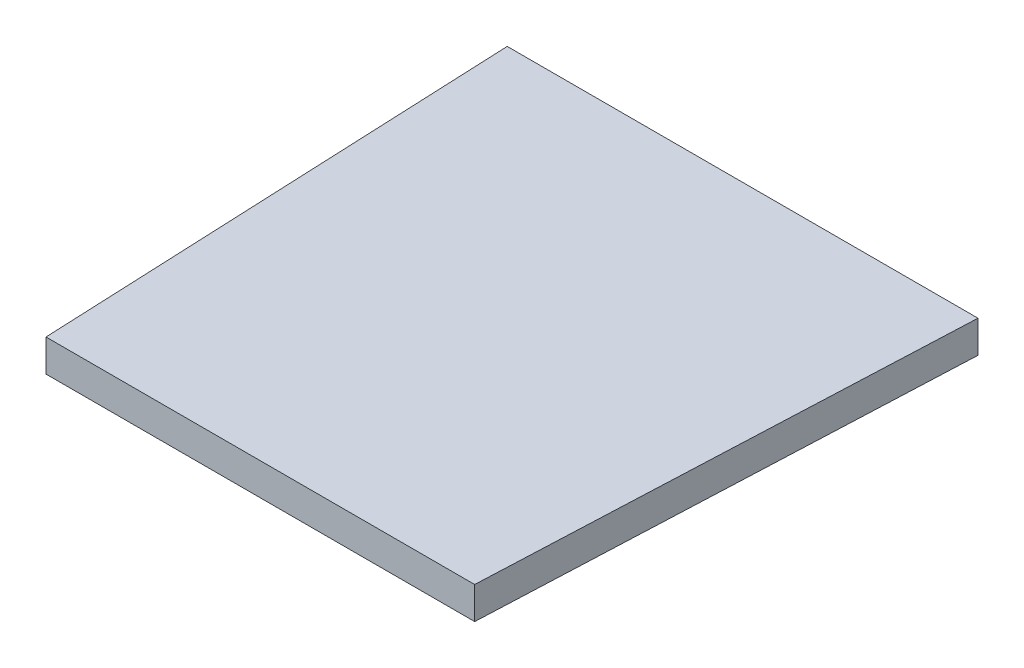
ISO-10303-21;
HEADER;
FILE_DESCRIPTION(('STEP AP214'),'2;1');
FILE_NAME('part.step','',(''),(''),'','','');
FILE_SCHEMA(('AUTOMOTIVE_DESIGN { 1 0 10303 214 1 1 1 1 }'));
ENDSEC;
DATA;
#1=APPLICATION_CONTEXT('core data for automotive mechanical design processes');
#2=APPLICATION_PROTOCOL_DEFINITION('international standard','automotive_design',2000,#1);
#3=PRODUCT_CONTEXT('',#1,'mechanical');
#4=PRODUCT('Part','Part','',(#3));
#5=PRODUCT_RELATED_PRODUCT_CATEGORY('part','',(#4));
#6=PRODUCT_DEFINITION_FORMATION('','',#4);
#7=PRODUCT_DEFINITION_CONTEXT('part definition',#1,'design');
#8=PRODUCT_DEFINITION('design','',#6,#7);
#9=PRODUCT_DEFINITION_SHAPE('','',#8);
#10=(LENGTH_UNIT() NAMED_UNIT(*) SI_UNIT(.MILLI.,.METRE.));
#11=(NAMED_UNIT(*) PLANE_ANGLE_UNIT() SI_UNIT($,.RADIAN.));
#12=(NAMED_UNIT(*) SI_UNIT($,.STERADIAN.) SOLID_ANGLE_UNIT());
#13=UNCERTAINTY_MEASURE_WITH_UNIT(LENGTH_MEASURE(1.E-05),#10,'distance_accuracy_value','');
#14=(GEOMETRIC_REPRESENTATION_CONTEXT(3) GLOBAL_UNCERTAINTY_ASSIGNED_CONTEXT((#13)) GLOBAL_UNIT_ASSIGNED_CONTEXT((#10,
#11,#12)) REPRESENTATION_CONTEXT('',''));
#15=CARTESIAN_POINT('',(0.,0.,0.));
#16=DIRECTION('',(0.,0.,1.));
#17=DIRECTION('',(1.,0.,0.));
#18=AXIS2_PLACEMENT_3D('',#15,#16,#17);
#19=CARTESIAN_POINT('',(-21.964742430883,3.,-100.));
#20=DIRECTION('',(0.,0.,1.));
#21=DIRECTION('',(1.,0.,0.));
#22=AXIS2_PLACEMENT_3D('',#19,#20,#21);
#23=PLANE('',#22);
#24=DIRECTION('',(-1.,0.,0.));
#25=VECTOR('',#24,1.);
#26=CARTESIAN_POINT('',(-21.964742430883,0.,-100.));
#27=LINE('',#26,#25);
#28=CARTESIAN_POINT('',(21.964742430883,0.,-100.));
#29=VERTEX_POINT('',#28);
#30=CARTESIAN_POINT('',(-21.964742430883,0.,-100.));
#31=VERTEX_POINT('',#30);
#32=EDGE_CURVE('E75',#29,#31,#27,.T.);
#33=ORIENTED_EDGE('',*,*,#32,.T.);
#34=DIRECTION('',(0.,-1.,0.));
#35=VECTOR('',#34,1.);
#36=CARTESIAN_POINT('',(-21.964742430883,3.,-100.));
#37=LINE('',#36,#35);
#38=CARTESIAN_POINT('',(-21.964742430883,3.,-100.));
#39=VERTEX_POINT('',#38);
#40=EDGE_CURVE('E11',#39,#31,#37,.T.);
#41=ORIENTED_EDGE('',*,*,#40,.F.);
#42=DIRECTION('',(-1.,0.,0.));
#43=VECTOR('',#42,1.);
#44=CARTESIAN_POINT('',(-21.964742430883,3.,-100.));
#45=LINE('',#44,#43);
#46=CARTESIAN_POINT('',(21.964742430883,3.,-100.));
#47=VERTEX_POINT('',#46);
#48=EDGE_CURVE('E66',#47,#39,#45,.T.);
#49=ORIENTED_EDGE('',*,*,#48,.F.);
#50=DIRECTION('',(0.,-1.,0.));
#51=VECTOR('',#50,1.);
#52=CARTESIAN_POINT('',(21.964742430883,3.,-100.));
#53=LINE('',#52,#51);
#54=EDGE_CURVE('E81',#47,#29,#53,.T.);
#55=ORIENTED_EDGE('',*,*,#54,.T.);
#56=EDGE_LOOP('',(#33,#41,#49,#55));
#57=FACE_BOUND('',#56,.T.);
#58=ADVANCED_FACE('F32',(#57),#23,.F.);
#59=CARTESIAN_POINT('',(-21.964742430883,3.,-100.));
#60=DIRECTION('',(0.999048221581858,0.,-0.0436193873653363));
#61=DIRECTION('',(-0.0436193873653363,0.,-0.999048221581858));
#62=AXIS2_PLACEMENT_3D('',#59,#60,#61);
#63=PLANE('',#62);
#64=DIRECTION('',(0.0436193873653363,0.,0.999048221581858));
#65=VECTOR('',#64,1.);
#66=CARTESIAN_POINT('',(-21.964742430883,0.,-100.));
#67=LINE('',#66,#65);
#68=CARTESIAN_POINT('',(-20.,0.,-55.));
#69=VERTEX_POINT('',#68);
#70=EDGE_CURVE('E59',#31,#69,#67,.T.);
#71=ORIENTED_EDGE('',*,*,#70,.T.);
#72=DIRECTION('',(0.,-1.,0.));
#73=VECTOR('',#72,1.);
#74=CARTESIAN_POINT('',(-20.,3.,-55.));
#75=LINE('',#74,#73);
#76=CARTESIAN_POINT('',(-20.,3.,-55.));
#77=VERTEX_POINT('',#76);
#78=EDGE_CURVE('E40',#77,#69,#75,.T.);
#79=ORIENTED_EDGE('',*,*,#78,.F.);
#80=DIRECTION('',(0.0436193873653363,0.,0.999048221581858));
#81=VECTOR('',#80,1.);
#82=CARTESIAN_POINT('',(-21.964742430883,3.,-100.));
#83=LINE('',#82,#81);
#84=EDGE_CURVE('E48',#39,#77,#83,.T.);
#85=ORIENTED_EDGE('',*,*,#84,.F.);
#86=ORIENTED_EDGE('',*,*,#40,.T.);
#87=EDGE_LOOP('',(#71,#79,#85,#86));
#88=FACE_BOUND('',#87,.T.);
#89=ADVANCED_FACE('F105',(#88),#63,.F.);
#90=CARTESIAN_POINT('',(0.,3.,-55.));
#91=DIRECTION('',(0.,0.,-1.));
#92=DIRECTION('',(-1.,0.,0.));
#93=AXIS2_PLACEMENT_3D('',#90,#91,#92);
#94=PLANE('',#93);
#95=DIRECTION('',(1.,0.,0.));
#96=VECTOR('',#95,1.);
#97=CARTESIAN_POINT('',(0.,0.,-55.));
#98=LINE('',#97,#96);
#99=CARTESIAN_POINT('',(20.,0.,-55.));
#100=VERTEX_POINT('',#99);
#101=EDGE_CURVE('E95',#69,#100,#98,.T.);
#102=ORIENTED_EDGE('',*,*,#101,.T.);
#103=DIRECTION('',(0.,-1.,0.));
#104=VECTOR('',#103,1.);
#105=CARTESIAN_POINT('',(20.,3.,-55.));
#106=LINE('',#105,#104);
#107=CARTESIAN_POINT('',(20.,3.,-55.));
#108=VERTEX_POINT('',#107);
#109=EDGE_CURVE('E79',#108,#100,#106,.T.);
#110=ORIENTED_EDGE('',*,*,#109,.F.);
#111=DIRECTION('',(1.,0.,0.));
#112=VECTOR('',#111,1.);
#113=CARTESIAN_POINT('',(0.,3.,-55.));
#114=LINE('',#113,#112);
#115=EDGE_CURVE('E97',#77,#108,#114,.T.);
#116=ORIENTED_EDGE('',*,*,#115,.F.);
#117=ORIENTED_EDGE('',*,*,#78,.T.);
#118=EDGE_LOOP('',(#102,#110,#116,#117));
#119=FACE_BOUND('',#118,.T.);
#120=ADVANCED_FACE('F103',(#119),#94,.F.);
#121=CARTESIAN_POINT('',(0.,3.,0.));
#122=DIRECTION('',(0.,-1.,0.));
#123=DIRECTION('',(0.,0.,-1.));
#124=AXIS2_PLACEMENT_3D('',#121,#122,#123);
#125=PLANE('',#124);
#126=ORIENTED_EDGE('',*,*,#48,.T.);
#127=ORIENTED_EDGE('',*,*,#84,.T.);
#128=ORIENTED_EDGE('',*,*,#115,.T.);
#129=DIRECTION('',(-0.0436193873653363,0.,0.999048221581858));
#130=VECTOR('',#129,1.);
#131=CARTESIAN_POINT('',(21.964742430883,3.,-100.));
#132=LINE('',#131,#130);
#133=EDGE_CURVE('E85',#47,#108,#132,.T.);
#134=ORIENTED_EDGE('',*,*,#133,.F.);
#135=EDGE_LOOP('',(#126,#127,#128,#134));
#136=FACE_BOUND('',#135,.T.);
#137=ADVANCED_FACE('F106',(#136),#125,.F.);
#138=CARTESIAN_POINT('',(0.,0.,0.));
#139=DIRECTION('',(0.,-1.,0.));
#140=DIRECTION('',(0.,0.,-1.));
#141=AXIS2_PLACEMENT_3D('',#138,#139,#140);
#142=PLANE('',#141);
#143=ORIENTED_EDGE('',*,*,#32,.F.);
#144=DIRECTION('',(-0.0436193873653363,0.,0.999048221581858));
#145=VECTOR('',#144,1.);
#146=CARTESIAN_POINT('',(21.964742430883,0.,-100.));
#147=LINE('',#146,#145);
#148=EDGE_CURVE('E78',#29,#100,#147,.T.);
#149=ORIENTED_EDGE('',*,*,#148,.T.);
#150=ORIENTED_EDGE('',*,*,#101,.F.);
#151=ORIENTED_EDGE('',*,*,#70,.F.);
#152=EDGE_LOOP('',(#143,#149,#150,#151));
#153=FACE_BOUND('',#152,.T.);
#154=ADVANCED_FACE('F76',(#153),#142,.T.);
#155=CARTESIAN_POINT('',(21.964742430883,3.,-100.));
#156=DIRECTION('',(0.999048221581858,0.,0.0436193873653363));
#157=DIRECTION('',(0.0436193873653363,0.,-0.999048221581858));
#158=AXIS2_PLACEMENT_3D('',#155,#156,#157);
#159=PLANE('',#158);
#160=ORIENTED_EDGE('',*,*,#148,.F.);
#161=ORIENTED_EDGE('',*,*,#54,.F.);
#162=ORIENTED_EDGE('',*,*,#133,.T.);
#163=ORIENTED_EDGE('',*,*,#109,.T.);
#164=EDGE_LOOP('',(#160,#161,#162,#163));
#165=FACE_BOUND('',#164,.T.);
#166=ADVANCED_FACE('F88',(#165),#159,.T.);
#167=CLOSED_SHELL('',(#58,#89,#120,#137,#154,#166));
#168=MANIFOLD_SOLID_BREP('B2',#167);
#169=ADVANCED_BREP_SHAPE_REPRESENTATION('',(#18,#168),#14);
#170=SHAPE_DEFINITION_REPRESENTATION(#9,#169);
ENDSEC;
END-ISO-10303-21;
